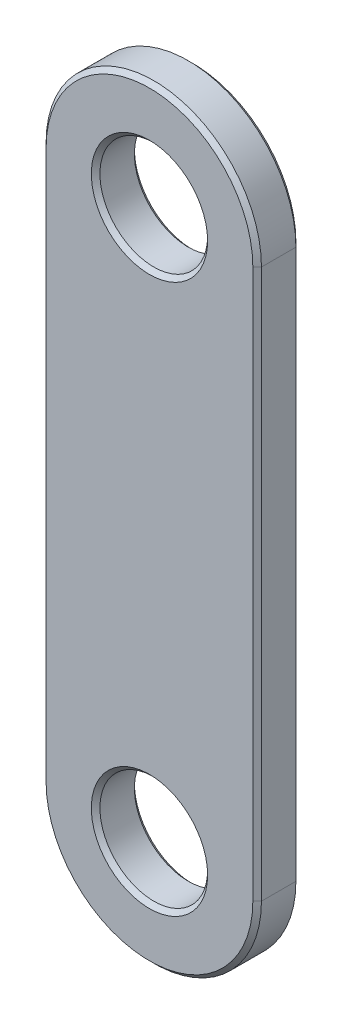
ISO-10303-21;
HEADER;
FILE_DESCRIPTION(('STEP AP214'),'2;1');
FILE_NAME('part.step','',(''),(''),'','','');
FILE_SCHEMA(('AUTOMOTIVE_DESIGN { 1 0 10303 214 1 1 1 1 }'));
ENDSEC;
DATA;
#1=APPLICATION_CONTEXT('core data for automotive mechanical design processes');
#2=APPLICATION_PROTOCOL_DEFINITION('international standard','automotive_design',2000,#1);
#3=PRODUCT_CONTEXT('',#1,'mechanical');
#4=PRODUCT('Part','Part','',(#3));
#5=PRODUCT_RELATED_PRODUCT_CATEGORY('part','',(#4));
#6=PRODUCT_DEFINITION_FORMATION('','',#4);
#7=PRODUCT_DEFINITION_CONTEXT('part definition',#1,'design');
#8=PRODUCT_DEFINITION('design','',#6,#7);
#9=PRODUCT_DEFINITION_SHAPE('','',#8);
#10=(LENGTH_UNIT() NAMED_UNIT(*) SI_UNIT(.MILLI.,.METRE.));
#11=(NAMED_UNIT(*) PLANE_ANGLE_UNIT() SI_UNIT($,.RADIAN.));
#12=(NAMED_UNIT(*) SI_UNIT($,.STERADIAN.) SOLID_ANGLE_UNIT());
#13=UNCERTAINTY_MEASURE_WITH_UNIT(LENGTH_MEASURE(1.E-05),#10,'distance_accuracy_value','');
#14=(GEOMETRIC_REPRESENTATION_CONTEXT(3) GLOBAL_UNCERTAINTY_ASSIGNED_CONTEXT((#13)) GLOBAL_UNIT_ASSIGNED_CONTEXT((#10,
#11,#12)) REPRESENTATION_CONTEXT('',''));
#15=CARTESIAN_POINT('',(0.,0.,0.));
#16=DIRECTION('',(0.,0.,1.));
#17=DIRECTION('',(1.,0.,0.));
#18=AXIS2_PLACEMENT_3D('',#15,#16,#17);
#19=CARTESIAN_POINT('',(0.,127.5,20.));
#20=DIRECTION('',(0.,0.,1.));
#21=DIRECTION('',(1.,0.,0.));
#22=AXIS2_PLACEMENT_3D('',#19,#20,#21);
#23=PLANE('',#22);
#24=CARTESIAN_POINT('',(0.,-127.5,20.));
#25=DIRECTION('',(0.,0.,1.));
#26=DIRECTION('',(1.,0.,0.));
#27=AXIS2_PLACEMENT_3D('',#24,#25,#26);
#28=CIRCLE('',#27,27.);
#29=CARTESIAN_POINT('',(27.0000000000001,-127.5,20.));
#30=VERTEX_POINT('',#29);
#31=EDGE_CURVE('E11',#30,#30,#28,.F.);
#32=ORIENTED_EDGE('',*,*,#31,.T.);
#33=EDGE_LOOP('',(#32));
#34=FACE_BOUND('',#33,.T.);
#35=CARTESIAN_POINT('',(0.,127.5,20.));
#36=DIRECTION('',(0.,0.,1.));
#37=DIRECTION('',(1.,0.,0.));
#38=AXIS2_PLACEMENT_3D('',#35,#36,#37);
#39=CIRCLE('',#38,27.);
#40=CARTESIAN_POINT('',(27.,127.5,20.));
#41=VERTEX_POINT('',#40);
#42=EDGE_CURVE('E42',#41,#41,#39,.F.);
#43=ORIENTED_EDGE('',*,*,#42,.T.);
#44=EDGE_LOOP('',(#43));
#45=FACE_BOUND('',#44,.T.);
#46=CARTESIAN_POINT('',(0.,-127.5,20.));
#47=DIRECTION('',(0.,0.,1.));
#48=DIRECTION('',(1.,0.,0.));
#49=AXIS2_PLACEMENT_3D('',#46,#47,#48);
#50=CIRCLE('',#49,48.);
#51=CARTESIAN_POINT('',(-48.,-127.5,20.));
#52=VERTEX_POINT('',#51);
#53=CARTESIAN_POINT('',(48.0000000000001,-127.5,20.));
#54=VERTEX_POINT('',#53);
#55=EDGE_CURVE('E50',#52,#54,#50,.T.);
#56=ORIENTED_EDGE('',*,*,#55,.T.);
#57=DIRECTION('',(0.,1.,0.));
#58=VECTOR('',#57,1.);
#59=CARTESIAN_POINT('',(48.,127.5,20.));
#60=LINE('',#59,#58);
#61=CARTESIAN_POINT('',(48.0000000000001,127.5,20.));
#62=VERTEX_POINT('',#61);
#63=EDGE_CURVE('E174',#54,#62,#60,.T.);
#64=ORIENTED_EDGE('',*,*,#63,.T.);
#65=CARTESIAN_POINT('',(0.,127.5,20.));
#66=DIRECTION('',(0.,0.,1.));
#67=DIRECTION('',(1.,0.,0.));
#68=AXIS2_PLACEMENT_3D('',#65,#66,#67);
#69=CIRCLE('',#68,48.);
#70=CARTESIAN_POINT('',(-47.9999999999999,127.5,20.));
#71=VERTEX_POINT('',#70);
#72=EDGE_CURVE('E170',#62,#71,#69,.T.);
#73=ORIENTED_EDGE('',*,*,#72,.T.);
#74=DIRECTION('',(0.,-1.,0.));
#75=VECTOR('',#74,1.);
#76=CARTESIAN_POINT('',(-48.,-127.5,20.));
#77=LINE('',#76,#75);
#78=EDGE_CURVE('E55',#71,#52,#77,.T.);
#79=ORIENTED_EDGE('',*,*,#78,.T.);
#80=EDGE_LOOP('',(#56,#64,#73,#79));
#81=FACE_BOUND('',#80,.T.);
#82=ADVANCED_FACE('F33',(#34,#45,#81),#23,.T.);
#83=CARTESIAN_POINT('',(0.,127.5,0.));
#84=DIRECTION('',(0.,0.,1.));
#85=DIRECTION('',(1.,0.,0.));
#86=AXIS2_PLACEMENT_3D('',#83,#84,#85);
#87=PLANE('',#86);
#88=CARTESIAN_POINT('',(0.,-127.5,0.));
#89=DIRECTION('',(0.,0.,1.));
#90=DIRECTION('',(1.,0.,0.));
#91=AXIS2_PLACEMENT_3D('',#88,#89,#90);
#92=CIRCLE('',#91,27.);
#93=CARTESIAN_POINT('',(27.0000000000001,-127.5,0.));
#94=VERTEX_POINT('',#93);
#95=EDGE_CURVE('E138',#94,#94,#92,.T.);
#96=ORIENTED_EDGE('',*,*,#95,.T.);
#97=EDGE_LOOP('',(#96));
#98=FACE_BOUND('',#97,.T.);
#99=CARTESIAN_POINT('',(0.,127.5,0.));
#100=DIRECTION('',(0.,0.,1.));
#101=DIRECTION('',(1.,0.,0.));
#102=AXIS2_PLACEMENT_3D('',#99,#100,#101);
#103=CIRCLE('',#102,27.);
#104=CARTESIAN_POINT('',(27.0000000000001,127.5,0.));
#105=VERTEX_POINT('',#104);
#106=EDGE_CURVE('E135',#105,#105,#103,.T.);
#107=ORIENTED_EDGE('',*,*,#106,.T.);
#108=EDGE_LOOP('',(#107));
#109=FACE_BOUND('',#108,.T.);
#110=CARTESIAN_POINT('',(0.,127.5,0.));
#111=DIRECTION('',(0.,0.,1.));
#112=DIRECTION('',(1.,0.,0.));
#113=AXIS2_PLACEMENT_3D('',#110,#111,#112);
#114=CIRCLE('',#113,48.);
#115=CARTESIAN_POINT('',(-47.9999999999999,127.5,0.));
#116=VERTEX_POINT('',#115);
#117=CARTESIAN_POINT('',(48.0000000000001,127.5,0.));
#118=VERTEX_POINT('',#117);
#119=EDGE_CURVE('E104',#116,#118,#114,.F.);
#120=ORIENTED_EDGE('',*,*,#119,.T.);
#121=DIRECTION('',(0.,-1.,0.));
#122=VECTOR('',#121,1.);
#123=CARTESIAN_POINT('',(48.,127.5,0.));
#124=LINE('',#123,#122);
#125=CARTESIAN_POINT('',(48.0000000000001,-127.5,0.));
#126=VERTEX_POINT('',#125);
#127=EDGE_CURVE('E133',#118,#126,#124,.T.);
#128=ORIENTED_EDGE('',*,*,#127,.T.);
#129=CARTESIAN_POINT('',(0.,-127.5,0.));
#130=DIRECTION('',(0.,0.,1.));
#131=DIRECTION('',(1.,0.,0.));
#132=AXIS2_PLACEMENT_3D('',#129,#130,#131);
#133=CIRCLE('',#132,48.);
#134=CARTESIAN_POINT('',(-48.,-127.5,0.));
#135=VERTEX_POINT('',#134);
#136=EDGE_CURVE('E107',#126,#135,#133,.F.);
#137=ORIENTED_EDGE('',*,*,#136,.T.);
#138=DIRECTION('',(0.,1.,0.));
#139=VECTOR('',#138,1.);
#140=CARTESIAN_POINT('',(-48.,127.5,0.));
#141=LINE('',#140,#139);
#142=EDGE_CURVE('E99',#135,#116,#141,.T.);
#143=ORIENTED_EDGE('',*,*,#142,.T.);
#144=EDGE_LOOP('',(#120,#128,#137,#143));
#145=FACE_BOUND('',#144,.T.);
#146=ADVANCED_FACE('F101',(#98,#109,#145),#87,.F.);
#147=CARTESIAN_POINT('',(0.,127.5,20.));
#148=DIRECTION('',(0.,0.,-1.));
#149=DIRECTION('',(-1.,0.,0.));
#150=AXIS2_PLACEMENT_3D('',#147,#148,#149);
#151=CYLINDRICAL_SURFACE('',#150,50.);
#152=DIRECTION('',(0.,0.,-1.));
#153=VECTOR('',#152,1.);
#154=CARTESIAN_POINT('',(50.,127.5,20.));
#155=LINE('',#154,#153);
#156=CARTESIAN_POINT('',(50.,127.5,18.));
#157=VERTEX_POINT('',#156);
#158=CARTESIAN_POINT('',(50.,127.5,2.00000000000001));
#159=VERTEX_POINT('',#158);
#160=EDGE_CURVE('E181',#157,#159,#155,.T.);
#161=ORIENTED_EDGE('',*,*,#160,.T.);
#162=CARTESIAN_POINT('',(0.,127.5,2.00000000000001));
#163=DIRECTION('',(0.,0.,1.));
#164=DIRECTION('',(1.,0.,0.));
#165=AXIS2_PLACEMENT_3D('',#162,#163,#164);
#166=CIRCLE('',#165,50.);
#167=CARTESIAN_POINT('',(-50.,127.5,2.00000000000001));
#168=VERTEX_POINT('',#167);
#169=EDGE_CURVE('E168',#159,#168,#166,.T.);
#170=ORIENTED_EDGE('',*,*,#169,.T.);
#171=DIRECTION('',(0.,0.,-1.));
#172=VECTOR('',#171,1.);
#173=CARTESIAN_POINT('',(-50.,127.5,20.));
#174=LINE('',#173,#172);
#175=CARTESIAN_POINT('',(-50.,127.5,18.));
#176=VERTEX_POINT('',#175);
#177=EDGE_CURVE('E125',#176,#168,#174,.T.);
#178=ORIENTED_EDGE('',*,*,#177,.F.);
#179=CARTESIAN_POINT('',(0.,127.5,18.));
#180=DIRECTION('',(0.,0.,1.));
#181=DIRECTION('',(1.,0.,0.));
#182=AXIS2_PLACEMENT_3D('',#179,#180,#181);
#183=CIRCLE('',#182,50.);
#184=EDGE_CURVE('E166',#176,#157,#183,.F.);
#185=ORIENTED_EDGE('',*,*,#184,.T.);
#186=EDGE_LOOP('',(#161,#170,#178,#185));
#187=FACE_BOUND('',#186,.T.);
#188=ADVANCED_FACE('F204',(#187),#151,.T.);
#189=CARTESIAN_POINT('',(-50.,127.5,20.));
#190=DIRECTION('',(1.,0.,0.));
#191=DIRECTION('',(0.,0.,-1.));
#192=AXIS2_PLACEMENT_3D('',#189,#190,#191);
#193=PLANE('',#192);
#194=ORIENTED_EDGE('',*,*,#177,.T.);
#195=DIRECTION('',(0.,-1.,0.));
#196=VECTOR('',#195,1.);
#197=CARTESIAN_POINT('',(-50.,127.5,2.00000000000001));
#198=LINE('',#197,#196);
#199=CARTESIAN_POINT('',(-50.,-127.5,2.00000000000001));
#200=VERTEX_POINT('',#199);
#201=EDGE_CURVE('E116',#168,#200,#198,.T.);
#202=ORIENTED_EDGE('',*,*,#201,.T.);
#203=DIRECTION('',(0.,0.,-1.));
#204=VECTOR('',#203,1.);
#205=CARTESIAN_POINT('',(-50.,-127.5,20.));
#206=LINE('',#205,#204);
#207=CARTESIAN_POINT('',(-50.,-127.5,18.));
#208=VERTEX_POINT('',#207);
#209=EDGE_CURVE('E128',#208,#200,#206,.T.);
#210=ORIENTED_EDGE('',*,*,#209,.F.);
#211=DIRECTION('',(0.,1.,0.));
#212=VECTOR('',#211,1.);
#213=CARTESIAN_POINT('',(-50.,127.5,18.));
#214=LINE('',#213,#212);
#215=EDGE_CURVE('E163',#208,#176,#214,.T.);
#216=ORIENTED_EDGE('',*,*,#215,.T.);
#217=EDGE_LOOP('',(#194,#202,#210,#216));
#218=FACE_BOUND('',#217,.T.);
#219=ADVANCED_FACE('F200',(#218),#193,.F.);
#220=CARTESIAN_POINT('',(0.,-127.5,20.));
#221=DIRECTION('',(0.,0.,-1.));
#222=DIRECTION('',(-1.,0.,0.));
#223=AXIS2_PLACEMENT_3D('',#220,#221,#222);
#224=CYLINDRICAL_SURFACE('',#223,50.);
#225=ORIENTED_EDGE('',*,*,#209,.T.);
#226=CARTESIAN_POINT('',(0.,-127.5,2.00000000000001));
#227=DIRECTION('',(0.,0.,1.));
#228=DIRECTION('',(1.,0.,0.));
#229=AXIS2_PLACEMENT_3D('',#226,#227,#228);
#230=CIRCLE('',#229,50.);
#231=CARTESIAN_POINT('',(50.,-127.5,2.00000000000001));
#232=VERTEX_POINT('',#231);
#233=EDGE_CURVE('E161',#200,#232,#230,.T.);
#234=ORIENTED_EDGE('',*,*,#233,.T.);
#235=DIRECTION('',(0.,0.,-1.));
#236=VECTOR('',#235,1.);
#237=CARTESIAN_POINT('',(50.,-127.5,20.));
#238=LINE('',#237,#236);
#239=CARTESIAN_POINT('',(50.,-127.5,18.));
#240=VERTEX_POINT('',#239);
#241=EDGE_CURVE('E212',#240,#232,#238,.T.);
#242=ORIENTED_EDGE('',*,*,#241,.F.);
#243=CARTESIAN_POINT('',(0.,-127.5,18.));
#244=DIRECTION('',(0.,0.,1.));
#245=DIRECTION('',(1.,0.,0.));
#246=AXIS2_PLACEMENT_3D('',#243,#244,#245);
#247=CIRCLE('',#246,50.);
#248=EDGE_CURVE('E159',#240,#208,#247,.F.);
#249=ORIENTED_EDGE('',*,*,#248,.T.);
#250=EDGE_LOOP('',(#225,#234,#242,#249));
#251=FACE_BOUND('',#250,.T.);
#252=ADVANCED_FACE('F220',(#251),#224,.T.);
#253=CARTESIAN_POINT('',(50.,127.5,20.));
#254=DIRECTION('',(-1.,0.,0.));
#255=DIRECTION('',(0.,0.,1.));
#256=AXIS2_PLACEMENT_3D('',#253,#254,#255);
#257=PLANE('',#256);
#258=ORIENTED_EDGE('',*,*,#241,.T.);
#259=DIRECTION('',(0.,1.,0.));
#260=VECTOR('',#259,1.);
#261=CARTESIAN_POINT('',(50.,127.5,2.00000000000001));
#262=LINE('',#261,#260);
#263=EDGE_CURVE('E156',#232,#159,#262,.T.);
#264=ORIENTED_EDGE('',*,*,#263,.T.);
#265=ORIENTED_EDGE('',*,*,#160,.F.);
#266=DIRECTION('',(0.,-1.,0.));
#267=VECTOR('',#266,1.);
#268=CARTESIAN_POINT('',(50.,-127.5,18.));
#269=LINE('',#268,#267);
#270=EDGE_CURVE('E153',#157,#240,#269,.T.);
#271=ORIENTED_EDGE('',*,*,#270,.T.);
#272=EDGE_LOOP('',(#258,#264,#265,#271));
#273=FACE_BOUND('',#272,.T.);
#274=ADVANCED_FACE('F209',(#273),#257,.F.);
#275=CARTESIAN_POINT('',(0.,127.5,20.));
#276=DIRECTION('',(0.,0.,-1.));
#277=DIRECTION('',(-1.,0.,0.));
#278=AXIS2_PLACEMENT_3D('',#275,#276,#277);
#279=CYLINDRICAL_SURFACE('',#278,25.);
#280=CARTESIAN_POINT('',(0.,127.5,2.00000000000002));
#281=DIRECTION('',(0.,0.,1.));
#282=DIRECTION('',(1.,0.,0.));
#283=AXIS2_PLACEMENT_3D('',#280,#281,#282);
#284=CIRCLE('',#283,25.);
#285=CARTESIAN_POINT('',(25.0000000000001,127.5,2.00000000000002));
#286=VERTEX_POINT('',#285);
#287=EDGE_CURVE('E150',#286,#286,#284,.F.);
#288=ORIENTED_EDGE('',*,*,#287,.T.);
#289=EDGE_LOOP('',(#288));
#290=FACE_BOUND('',#289,.T.);
#291=CARTESIAN_POINT('',(0.,127.5,18.));
#292=DIRECTION('',(0.,0.,1.));
#293=DIRECTION('',(1.,0.,0.));
#294=AXIS2_PLACEMENT_3D('',#291,#292,#293);
#295=CIRCLE('',#294,25.);
#296=CARTESIAN_POINT('',(25.0000000000001,127.5,18.));
#297=VERTEX_POINT('',#296);
#298=EDGE_CURVE('E147',#297,#297,#295,.T.);
#299=ORIENTED_EDGE('',*,*,#298,.T.);
#300=EDGE_LOOP('',(#299));
#301=FACE_BOUND('',#300,.T.);
#302=ADVANCED_FACE('F229',(#290,#301),#279,.F.);
#303=CARTESIAN_POINT('',(0.,-127.5,20.));
#304=DIRECTION('',(0.,0.,-1.));
#305=DIRECTION('',(-1.,0.,0.));
#306=AXIS2_PLACEMENT_3D('',#303,#304,#305);
#307=CYLINDRICAL_SURFACE('',#306,25.);
#308=CARTESIAN_POINT('',(0.,-127.5,2.00000000000002));
#309=DIRECTION('',(0.,0.,1.));
#310=DIRECTION('',(1.,0.,0.));
#311=AXIS2_PLACEMENT_3D('',#308,#309,#310);
#312=CIRCLE('',#311,25.);
#313=CARTESIAN_POINT('',(25.0000000000001,-127.5,2.00000000000002));
#314=VERTEX_POINT('',#313);
#315=EDGE_CURVE('E144',#314,#314,#312,.F.);
#316=ORIENTED_EDGE('',*,*,#315,.T.);
#317=EDGE_LOOP('',(#316));
#318=FACE_BOUND('',#317,.T.);
#319=CARTESIAN_POINT('',(0.,-127.5,18.));
#320=DIRECTION('',(0.,0.,1.));
#321=DIRECTION('',(1.,0.,0.));
#322=AXIS2_PLACEMENT_3D('',#319,#320,#321);
#323=CIRCLE('',#322,25.);
#324=CARTESIAN_POINT('',(25.0000000000001,-127.5,18.));
#325=VERTEX_POINT('',#324);
#326=EDGE_CURVE('E141',#325,#325,#323,.T.);
#327=ORIENTED_EDGE('',*,*,#326,.T.);
#328=EDGE_LOOP('',(#327));
#329=FACE_BOUND('',#328,.T.);
#330=ADVANCED_FACE('F244',(#318,#329),#307,.F.);
#331=CARTESIAN_POINT('',(0.,-127.5,0.));
#332=DIRECTION('',(0.,0.,-1.));
#333=DIRECTION('',(-1.,0.,0.));
#334=AXIS2_PLACEMENT_3D('',#331,#332,#333);
#335=CONICAL_SURFACE('',#334,27.,0.785398163397449);
#336=ORIENTED_EDGE('',*,*,#315,.F.);
#337=EDGE_LOOP('',(#336));
#338=FACE_BOUND('',#337,.T.);
#339=ORIENTED_EDGE('',*,*,#95,.F.);
#340=EDGE_LOOP('',(#339));
#341=FACE_BOUND('',#340,.T.);
#342=ADVANCED_FACE('F247',(#338,#341),#335,.F.);
#343=CARTESIAN_POINT('',(0.,127.5,0.));
#344=DIRECTION('',(0.,0.,-1.));
#345=DIRECTION('',(-1.,0.,0.));
#346=AXIS2_PLACEMENT_3D('',#343,#344,#345);
#347=CONICAL_SURFACE('',#346,27.,0.78539816339745);
#348=ORIENTED_EDGE('',*,*,#287,.F.);
#349=EDGE_LOOP('',(#348));
#350=FACE_BOUND('',#349,.T.);
#351=ORIENTED_EDGE('',*,*,#106,.F.);
#352=EDGE_LOOP('',(#351));
#353=FACE_BOUND('',#352,.T.);
#354=ADVANCED_FACE('F252',(#350,#353),#347,.F.);
#355=CARTESIAN_POINT('',(-50.,127.5,2.00000000000001));
#356=DIRECTION('',(0.707106781186549,0.,0.707106781186546));
#357=DIRECTION('',(0.,-1.,0.));
#358=AXIS2_PLACEMENT_3D('',#355,#356,#357);
#359=PLANE('',#358);
#360=DIRECTION('',(-0.707106781186546,0.,0.707106781186549));
#361=VECTOR('',#360,1.);
#362=CARTESIAN_POINT('',(-48.,127.5,0.));
#363=LINE('',#362,#361);
#364=EDGE_CURVE('E114',#116,#168,#363,.T.);
#365=ORIENTED_EDGE('',*,*,#364,.F.);
#366=ORIENTED_EDGE('',*,*,#142,.F.);
#367=DIRECTION('',(0.707106781186546,0.,-0.707106781186549));
#368=VECTOR('',#367,1.);
#369=CARTESIAN_POINT('',(-50.,-127.5,2.00000000000001));
#370=LINE('',#369,#368);
#371=EDGE_CURVE('E119',#200,#135,#370,.T.);
#372=ORIENTED_EDGE('',*,*,#371,.F.);
#373=ORIENTED_EDGE('',*,*,#201,.F.);
#374=EDGE_LOOP('',(#365,#366,#372,#373));
#375=FACE_BOUND('',#374,.T.);
#376=ADVANCED_FACE('F115',(#375),#359,.F.);
#377=CARTESIAN_POINT('',(0.,-127.5,2.00000000000001));
#378=DIRECTION('',(0.,0.,1.));
#379=DIRECTION('',(1.,0.,0.));
#380=AXIS2_PLACEMENT_3D('',#377,#378,#379);
#381=CONICAL_SURFACE('',#380,50.,0.785398163397447);
#382=ORIENTED_EDGE('',*,*,#371,.T.);
#383=ORIENTED_EDGE('',*,*,#136,.F.);
#384=DIRECTION('',(-0.707106781186546,0.,-0.707106781186549));
#385=VECTOR('',#384,1.);
#386=CARTESIAN_POINT('',(50.0000000000001,-127.5,2.00000000000001));
#387=LINE('',#386,#385);
#388=EDGE_CURVE('E120',#232,#126,#387,.T.);
#389=ORIENTED_EDGE('',*,*,#388,.F.);
#390=ORIENTED_EDGE('',*,*,#233,.F.);
#391=EDGE_LOOP('',(#382,#383,#389,#390));
#392=FACE_BOUND('',#391,.T.);
#393=ADVANCED_FACE('F218',(#392),#381,.T.);
#394=CARTESIAN_POINT('',(0.,127.5,2.00000000000001));
#395=DIRECTION('',(0.,0.,1.));
#396=DIRECTION('',(1.,0.,0.));
#397=AXIS2_PLACEMENT_3D('',#394,#395,#396);
#398=CONICAL_SURFACE('',#397,50.,0.785398163397447);
#399=ORIENTED_EDGE('',*,*,#364,.T.);
#400=ORIENTED_EDGE('',*,*,#169,.F.);
#401=DIRECTION('',(0.707106781186546,0.,0.707106781186549));
#402=VECTOR('',#401,1.);
#403=CARTESIAN_POINT('',(48.0000000000001,127.5,0.));
#404=LINE('',#403,#402);
#405=EDGE_CURVE('E124',#118,#159,#404,.T.);
#406=ORIENTED_EDGE('',*,*,#405,.F.);
#407=ORIENTED_EDGE('',*,*,#119,.F.);
#408=EDGE_LOOP('',(#399,#400,#406,#407));
#409=FACE_BOUND('',#408,.T.);
#410=ADVANCED_FACE('F123',(#409),#398,.T.);
#411=CARTESIAN_POINT('',(50.,127.5,2.00000000000001));
#412=DIRECTION('',(-0.707106781186549,0.,0.707106781186546));
#413=DIRECTION('',(0.,1.,0.));
#414=AXIS2_PLACEMENT_3D('',#411,#412,#413);
#415=PLANE('',#414);
#416=ORIENTED_EDGE('',*,*,#388,.T.);
#417=ORIENTED_EDGE('',*,*,#127,.F.);
#418=ORIENTED_EDGE('',*,*,#405,.T.);
#419=ORIENTED_EDGE('',*,*,#263,.F.);
#420=EDGE_LOOP('',(#416,#417,#418,#419));
#421=FACE_BOUND('',#420,.T.);
#422=ADVANCED_FACE('F215',(#421),#415,.F.);
#423=CARTESIAN_POINT('',(0.,-127.5,18.));
#424=DIRECTION('',(0.,0.,1.));
#425=DIRECTION('',(1.,0.,0.));
#426=AXIS2_PLACEMENT_3D('',#423,#424,#425);
#427=CONICAL_SURFACE('',#426,25.,0.785398163397454);
#428=ORIENTED_EDGE('',*,*,#31,.F.);
#429=EDGE_LOOP('',(#428));
#430=FACE_BOUND('',#429,.T.);
#431=ORIENTED_EDGE('',*,*,#326,.F.);
#432=EDGE_LOOP('',(#431));
#433=FACE_BOUND('',#432,.T.);
#434=ADVANCED_FACE('F259',(#430,#433),#427,.F.);
#435=CARTESIAN_POINT('',(0.,127.5,18.));
#436=DIRECTION('',(0.,0.,1.));
#437=DIRECTION('',(1.,0.,0.));
#438=AXIS2_PLACEMENT_3D('',#435,#436,#437);
#439=CONICAL_SURFACE('',#438,25.,0.785398163397453);
#440=ORIENTED_EDGE('',*,*,#42,.F.);
#441=EDGE_LOOP('',(#440));
#442=FACE_BOUND('',#441,.T.);
#443=ORIENTED_EDGE('',*,*,#298,.F.);
#444=EDGE_LOOP('',(#443));
#445=FACE_BOUND('',#444,.T.);
#446=ADVANCED_FACE('F261',(#442,#445),#439,.F.);
#447=CARTESIAN_POINT('',(-48.,127.5,20.));
#448=DIRECTION('',(-0.707106781186549,0.,0.707106781186546));
#449=DIRECTION('',(0.,1.,0.));
#450=AXIS2_PLACEMENT_3D('',#447,#448,#449);
#451=PLANE('',#450);
#452=DIRECTION('',(0.707106781186546,0.,0.707106781186549));
#453=VECTOR('',#452,1.);
#454=CARTESIAN_POINT('',(-50.,127.5,18.));
#455=LINE('',#454,#453);
#456=EDGE_CURVE('E185',#176,#71,#455,.T.);
#457=ORIENTED_EDGE('',*,*,#456,.F.);
#458=ORIENTED_EDGE('',*,*,#215,.F.);
#459=DIRECTION('',(-0.707106781186546,0.,-0.707106781186549));
#460=VECTOR('',#459,1.);
#461=CARTESIAN_POINT('',(-48.,-127.5,20.));
#462=LINE('',#461,#460);
#463=EDGE_CURVE('E37',#52,#208,#462,.T.);
#464=ORIENTED_EDGE('',*,*,#463,.F.);
#465=ORIENTED_EDGE('',*,*,#78,.F.);
#466=EDGE_LOOP('',(#457,#458,#464,#465));
#467=FACE_BOUND('',#466,.T.);
#468=ADVANCED_FACE('F35',(#467),#451,.T.);
#469=CARTESIAN_POINT('',(0.,-127.5,20.));
#470=DIRECTION('',(0.,0.,-1.));
#471=DIRECTION('',(-1.,0.,0.));
#472=AXIS2_PLACEMENT_3D('',#469,#470,#471);
#473=CONICAL_SURFACE('',#472,48.,0.785398163397447);
#474=ORIENTED_EDGE('',*,*,#463,.T.);
#475=ORIENTED_EDGE('',*,*,#248,.F.);
#476=DIRECTION('',(0.707106781186546,0.,-0.707106781186549));
#477=VECTOR('',#476,1.);
#478=CARTESIAN_POINT('',(48.0000000000001,-127.5,20.));
#479=LINE('',#478,#477);
#480=EDGE_CURVE('E184',#54,#240,#479,.T.);
#481=ORIENTED_EDGE('',*,*,#480,.F.);
#482=ORIENTED_EDGE('',*,*,#55,.F.);
#483=EDGE_LOOP('',(#474,#475,#481,#482));
#484=FACE_BOUND('',#483,.T.);
#485=ADVANCED_FACE('F194',(#484),#473,.T.);
#486=CARTESIAN_POINT('',(0.,127.5,20.));
#487=DIRECTION('',(0.,0.,-1.));
#488=DIRECTION('',(-1.,0.,0.));
#489=AXIS2_PLACEMENT_3D('',#486,#487,#488);
#490=CONICAL_SURFACE('',#489,48.,0.785398163397447);
#491=ORIENTED_EDGE('',*,*,#456,.T.);
#492=ORIENTED_EDGE('',*,*,#72,.F.);
#493=DIRECTION('',(-0.707106781186546,0.,0.707106781186549));
#494=VECTOR('',#493,1.);
#495=CARTESIAN_POINT('',(50.0000000000001,127.5,18.));
#496=LINE('',#495,#494);
#497=EDGE_CURVE('E182',#157,#62,#496,.T.);
#498=ORIENTED_EDGE('',*,*,#497,.F.);
#499=ORIENTED_EDGE('',*,*,#184,.F.);
#500=EDGE_LOOP('',(#491,#492,#498,#499));
#501=FACE_BOUND('',#500,.T.);
#502=ADVANCED_FACE('F278',(#501),#490,.T.);
#503=CARTESIAN_POINT('',(48.,127.5,20.));
#504=DIRECTION('',(0.707106781186549,0.,0.707106781186546));
#505=DIRECTION('',(0.,-1.,0.));
#506=AXIS2_PLACEMENT_3D('',#503,#504,#505);
#507=PLANE('',#506);
#508=ORIENTED_EDGE('',*,*,#480,.T.);
#509=ORIENTED_EDGE('',*,*,#270,.F.);
#510=ORIENTED_EDGE('',*,*,#497,.T.);
#511=ORIENTED_EDGE('',*,*,#63,.F.);
#512=EDGE_LOOP('',(#508,#509,#510,#511));
#513=FACE_BOUND('',#512,.T.);
#514=ADVANCED_FACE('F275',(#513),#507,.T.);
#515=CLOSED_SHELL('',(#82,#146,#188,#219,#252,#274,#302,#330,#342,#354,#376,#393,#410,#422,#434,
#446,#468,#485,#502,#514));
#516=MANIFOLD_SOLID_BREP('B2',#515);
#517=ADVANCED_BREP_SHAPE_REPRESENTATION('',(#18,#516),#14);
#518=SHAPE_DEFINITION_REPRESENTATION(#9,#517);
ENDSEC;
END-ISO-10303-21;
